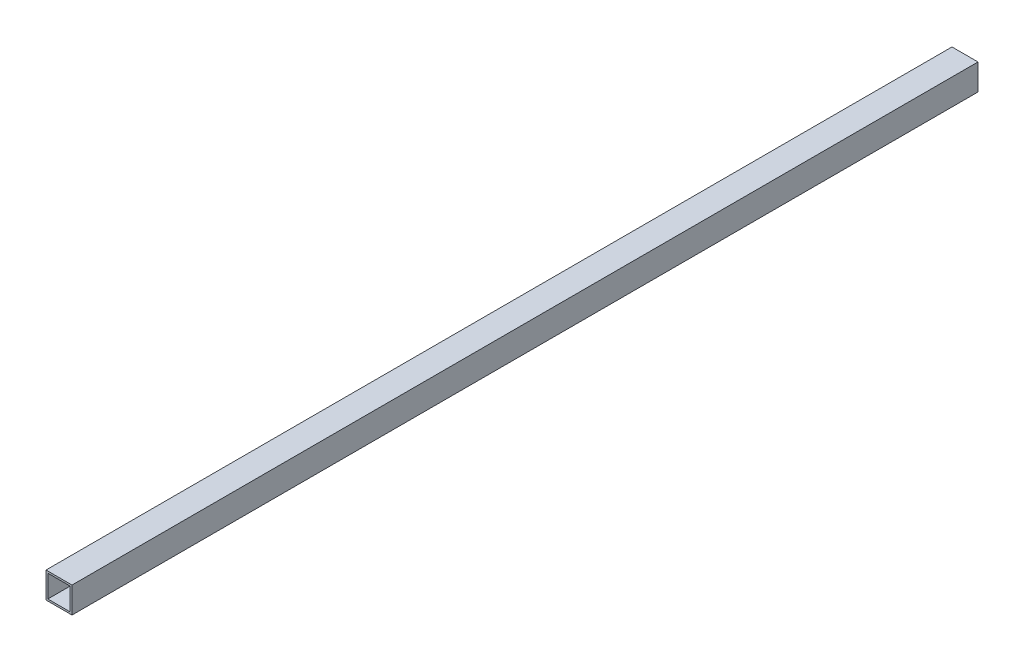
ISO-10303-21;
HEADER;
FILE_DESCRIPTION(('STEP AP214'),'2;1');
FILE_NAME('part.step','',(''),(''),'','','');
FILE_SCHEMA(('AUTOMOTIVE_DESIGN { 1 0 10303 214 1 1 1 1 }'));
ENDSEC;
DATA;
#1=APPLICATION_CONTEXT('core data for automotive mechanical design processes');
#2=APPLICATION_PROTOCOL_DEFINITION('international standard','automotive_design',2000,#1);
#3=PRODUCT_CONTEXT('',#1,'mechanical');
#4=PRODUCT('Part','Part','',(#3));
#5=PRODUCT_RELATED_PRODUCT_CATEGORY('part','',(#4));
#6=PRODUCT_DEFINITION_FORMATION('','',#4);
#7=PRODUCT_DEFINITION_CONTEXT('part definition',#1,'design');
#8=PRODUCT_DEFINITION('design','',#6,#7);
#9=PRODUCT_DEFINITION_SHAPE('','',#8);
#10=(LENGTH_UNIT() NAMED_UNIT(*) SI_UNIT(.MILLI.,.METRE.));
#11=(NAMED_UNIT(*) PLANE_ANGLE_UNIT() SI_UNIT($,.RADIAN.));
#12=(NAMED_UNIT(*) SI_UNIT($,.STERADIAN.) SOLID_ANGLE_UNIT());
#13=UNCERTAINTY_MEASURE_WITH_UNIT(LENGTH_MEASURE(1.E-05),#10,'distance_accuracy_value','');
#14=(GEOMETRIC_REPRESENTATION_CONTEXT(3) GLOBAL_UNCERTAINTY_ASSIGNED_CONTEXT((#13)) GLOBAL_UNIT_ASSIGNED_CONTEXT((#10,
#11,#12)) REPRESENTATION_CONTEXT('',''));
#15=CARTESIAN_POINT('',(0.,0.,0.));
#16=DIRECTION('',(0.,0.,1.));
#17=DIRECTION('',(1.,0.,0.));
#18=AXIS2_PLACEMENT_3D('',#15,#16,#17);
#19=CARTESIAN_POINT('',(0.,0.,592.));
#20=DIRECTION('',(0.,0.,-1.));
#21=DIRECTION('',(-1.,0.,0.));
#22=AXIS2_PLACEMENT_3D('',#19,#20,#21);
#23=PLANE('',#22);
#24=DIRECTION('',(0.,1.,0.));
#25=VECTOR('',#24,1.);
#26=CARTESIAN_POINT('',(8.5,-8.5,592.));
#27=LINE('',#26,#25);
#28=CARTESIAN_POINT('',(8.5,-8.5,592.));
#29=VERTEX_POINT('',#28);
#30=CARTESIAN_POINT('',(8.5,8.5,592.));
#31=VERTEX_POINT('',#30);
#32=EDGE_CURVE('E153',#29,#31,#27,.T.);
#33=ORIENTED_EDGE('',*,*,#32,.T.);
#34=DIRECTION('',(-1.,0.,0.));
#35=VECTOR('',#34,1.);
#36=CARTESIAN_POINT('',(-8.5,8.5,592.));
#37=LINE('',#36,#35);
#38=CARTESIAN_POINT('',(-8.5,8.5,592.));
#39=VERTEX_POINT('',#38);
#40=EDGE_CURVE('E157',#31,#39,#37,.T.);
#41=ORIENTED_EDGE('',*,*,#40,.T.);
#42=DIRECTION('',(0.,-1.,0.));
#43=VECTOR('',#42,1.);
#44=CARTESIAN_POINT('',(-8.5,-8.5,592.));
#45=LINE('',#44,#43);
#46=CARTESIAN_POINT('',(-8.5,-8.5,592.));
#47=VERTEX_POINT('',#46);
#48=EDGE_CURVE('E161',#39,#47,#45,.T.);
#49=ORIENTED_EDGE('',*,*,#48,.T.);
#50=DIRECTION('',(1.,0.,0.));
#51=VECTOR('',#50,1.);
#52=CARTESIAN_POINT('',(-8.5,-8.5,592.));
#53=LINE('',#52,#51);
#54=EDGE_CURVE('E164',#47,#29,#53,.T.);
#55=ORIENTED_EDGE('',*,*,#54,.T.);
#56=EDGE_LOOP('',(#33,#41,#49,#55));
#57=FACE_BOUND('',#56,.T.);
#58=DIRECTION('',(0.,-1.,0.));
#59=VECTOR('',#58,1.);
#60=CARTESIAN_POINT('',(-7.3,-7.3,592.));
#61=LINE('',#60,#59);
#62=CARTESIAN_POINT('',(-7.3,7.3,592.));
#63=VERTEX_POINT('',#62);
#64=CARTESIAN_POINT('',(-7.3,-7.3,592.));
#65=VERTEX_POINT('',#64);
#66=EDGE_CURVE('E105',#63,#65,#61,.T.);
#67=ORIENTED_EDGE('',*,*,#66,.F.);
#68=DIRECTION('',(-1.,0.,0.));
#69=VECTOR('',#68,1.);
#70=CARTESIAN_POINT('',(-7.3,7.3,592.));
#71=LINE('',#70,#69);
#72=CARTESIAN_POINT('',(7.3,7.3,592.));
#73=VERTEX_POINT('',#72);
#74=EDGE_CURVE('E131',#73,#63,#71,.T.);
#75=ORIENTED_EDGE('',*,*,#74,.F.);
#76=DIRECTION('',(0.,1.,0.));
#77=VECTOR('',#76,1.);
#78=CARTESIAN_POINT('',(7.3,-7.3,592.));
#79=LINE('',#78,#77);
#80=CARTESIAN_POINT('',(7.3,-7.3,592.));
#81=VERTEX_POINT('',#80);
#82=EDGE_CURVE('E127',#81,#73,#79,.T.);
#83=ORIENTED_EDGE('',*,*,#82,.F.);
#84=DIRECTION('',(1.,0.,0.));
#85=VECTOR('',#84,1.);
#86=CARTESIAN_POINT('',(-7.3,-7.3,592.));
#87=LINE('',#86,#85);
#88=EDGE_CURVE('E114',#65,#81,#87,.T.);
#89=ORIENTED_EDGE('',*,*,#88,.F.);
#90=EDGE_LOOP('',(#67,#75,#83,#89));
#91=FACE_BOUND('',#90,.T.);
#92=ADVANCED_FACE('F39',(#57,#91),#23,.F.);
#93=CARTESIAN_POINT('',(0.,0.,0.));
#94=DIRECTION('',(0.,0.,-1.));
#95=DIRECTION('',(-1.,0.,0.));
#96=AXIS2_PLACEMENT_3D('',#93,#94,#95);
#97=PLANE('',#96);
#98=DIRECTION('',(0.,1.,0.));
#99=VECTOR('',#98,1.);
#100=CARTESIAN_POINT('',(8.5,-8.5,0.));
#101=LINE('',#100,#99);
#102=CARTESIAN_POINT('',(8.5,-8.5,0.));
#103=VERTEX_POINT('',#102);
#104=CARTESIAN_POINT('',(8.5,8.5,0.));
#105=VERTEX_POINT('',#104);
#106=EDGE_CURVE('E123',#103,#105,#101,.T.);
#107=ORIENTED_EDGE('',*,*,#106,.F.);
#108=DIRECTION('',(1.,0.,0.));
#109=VECTOR('',#108,1.);
#110=CARTESIAN_POINT('',(-8.5,-8.5,0.));
#111=LINE('',#110,#109);
#112=CARTESIAN_POINT('',(-8.5,-8.5,0.));
#113=VERTEX_POINT('',#112);
#114=EDGE_CURVE('E158',#113,#103,#111,.T.);
#115=ORIENTED_EDGE('',*,*,#114,.F.);
#116=DIRECTION('',(0.,-1.,0.));
#117=VECTOR('',#116,1.);
#118=CARTESIAN_POINT('',(-8.5,-8.5,0.));
#119=LINE('',#118,#117);
#120=CARTESIAN_POINT('',(-8.5,8.5,0.));
#121=VERTEX_POINT('',#120);
#122=EDGE_CURVE('E174',#121,#113,#119,.T.);
#123=ORIENTED_EDGE('',*,*,#122,.F.);
#124=DIRECTION('',(-1.,0.,0.));
#125=VECTOR('',#124,1.);
#126=CARTESIAN_POINT('',(-8.5,8.5,0.));
#127=LINE('',#126,#125);
#128=EDGE_CURVE('E171',#105,#121,#127,.T.);
#129=ORIENTED_EDGE('',*,*,#128,.F.);
#130=EDGE_LOOP('',(#107,#115,#123,#129));
#131=FACE_BOUND('',#130,.T.);
#132=DIRECTION('',(-1.,0.,0.));
#133=VECTOR('',#132,1.);
#134=CARTESIAN_POINT('',(-7.3,7.3,0.));
#135=LINE('',#134,#133);
#136=CARTESIAN_POINT('',(7.3,7.3,0.));
#137=VERTEX_POINT('',#136);
#138=CARTESIAN_POINT('',(-7.3,7.3,0.));
#139=VERTEX_POINT('',#138);
#140=EDGE_CURVE('E115',#137,#139,#135,.T.);
#141=ORIENTED_EDGE('',*,*,#140,.T.);
#142=DIRECTION('',(0.,-1.,0.));
#143=VECTOR('',#142,1.);
#144=CARTESIAN_POINT('',(-7.3,-7.3,0.));
#145=LINE('',#144,#143);
#146=CARTESIAN_POINT('',(-7.3,-7.3,0.));
#147=VERTEX_POINT('',#146);
#148=EDGE_CURVE('E63',#139,#147,#145,.T.);
#149=ORIENTED_EDGE('',*,*,#148,.T.);
#150=DIRECTION('',(1.,0.,0.));
#151=VECTOR('',#150,1.);
#152=CARTESIAN_POINT('',(-7.3,-7.3,0.));
#153=LINE('',#152,#151);
#154=CARTESIAN_POINT('',(7.3,-7.3,0.));
#155=VERTEX_POINT('',#154);
#156=EDGE_CURVE('E121',#147,#155,#153,.T.);
#157=ORIENTED_EDGE('',*,*,#156,.T.);
#158=DIRECTION('',(0.,1.,0.));
#159=VECTOR('',#158,1.);
#160=CARTESIAN_POINT('',(7.3,-7.3,0.));
#161=LINE('',#160,#159);
#162=EDGE_CURVE('E140',#155,#137,#161,.T.);
#163=ORIENTED_EDGE('',*,*,#162,.T.);
#164=EDGE_LOOP('',(#141,#149,#157,#163));
#165=FACE_BOUND('',#164,.T.);
#166=ADVANCED_FACE('F197',(#131,#165),#97,.T.);
#167=CARTESIAN_POINT('',(8.5,-8.5,592.));
#168=DIRECTION('',(-1.,0.,0.));
#169=DIRECTION('',(0.,0.,1.));
#170=AXIS2_PLACEMENT_3D('',#167,#168,#169);
#171=PLANE('',#170);
#172=ORIENTED_EDGE('',*,*,#106,.T.);
#173=DIRECTION('',(0.,0.,-1.));
#174=VECTOR('',#173,1.);
#175=CARTESIAN_POINT('',(8.5,8.5,592.));
#176=LINE('',#175,#174);
#177=EDGE_CURVE('E11',#31,#105,#176,.T.);
#178=ORIENTED_EDGE('',*,*,#177,.F.);
#179=ORIENTED_EDGE('',*,*,#32,.F.);
#180=DIRECTION('',(0.,0.,-1.));
#181=VECTOR('',#180,1.);
#182=CARTESIAN_POINT('',(8.5,-8.5,592.));
#183=LINE('',#182,#181);
#184=EDGE_CURVE('E167',#29,#103,#183,.T.);
#185=ORIENTED_EDGE('',*,*,#184,.T.);
#186=EDGE_LOOP('',(#172,#178,#179,#185));
#187=FACE_BOUND('',#186,.T.);
#188=ADVANCED_FACE('F41',(#187),#171,.F.);
#189=CARTESIAN_POINT('',(-8.5,8.5,592.));
#190=DIRECTION('',(0.,-1.,0.));
#191=DIRECTION('',(0.,0.,-1.));
#192=AXIS2_PLACEMENT_3D('',#189,#190,#191);
#193=PLANE('',#192);
#194=ORIENTED_EDGE('',*,*,#128,.T.);
#195=DIRECTION('',(0.,0.,-1.));
#196=VECTOR('',#195,1.);
#197=CARTESIAN_POINT('',(-8.5,8.5,592.));
#198=LINE('',#197,#196);
#199=EDGE_CURVE('E48',#39,#121,#198,.T.);
#200=ORIENTED_EDGE('',*,*,#199,.F.);
#201=ORIENTED_EDGE('',*,*,#40,.F.);
#202=ORIENTED_EDGE('',*,*,#177,.T.);
#203=EDGE_LOOP('',(#194,#200,#201,#202));
#204=FACE_BOUND('',#203,.T.);
#205=ADVANCED_FACE('F207',(#204),#193,.F.);
#206=CARTESIAN_POINT('',(-8.5,-8.5,592.));
#207=DIRECTION('',(1.,0.,0.));
#208=DIRECTION('',(0.,0.,-1.));
#209=AXIS2_PLACEMENT_3D('',#206,#207,#208);
#210=PLANE('',#209);
#211=ORIENTED_EDGE('',*,*,#122,.T.);
#212=DIRECTION('',(0.,0.,-1.));
#213=VECTOR('',#212,1.);
#214=CARTESIAN_POINT('',(-8.5,-8.5,592.));
#215=LINE('',#214,#213);
#216=EDGE_CURVE('E182',#47,#113,#215,.T.);
#217=ORIENTED_EDGE('',*,*,#216,.F.);
#218=ORIENTED_EDGE('',*,*,#48,.F.);
#219=ORIENTED_EDGE('',*,*,#199,.T.);
#220=EDGE_LOOP('',(#211,#217,#218,#219));
#221=FACE_BOUND('',#220,.T.);
#222=ADVANCED_FACE('F191',(#221),#210,.F.);
#223=CARTESIAN_POINT('',(-8.5,-8.5,592.));
#224=DIRECTION('',(0.,1.,0.));
#225=DIRECTION('',(0.,0.,1.));
#226=AXIS2_PLACEMENT_3D('',#223,#224,#225);
#227=PLANE('',#226);
#228=ORIENTED_EDGE('',*,*,#114,.T.);
#229=ORIENTED_EDGE('',*,*,#184,.F.);
#230=ORIENTED_EDGE('',*,*,#54,.F.);
#231=ORIENTED_EDGE('',*,*,#216,.T.);
#232=EDGE_LOOP('',(#228,#229,#230,#231));
#233=FACE_BOUND('',#232,.T.);
#234=ADVANCED_FACE('F201',(#233),#227,.F.);
#235=CARTESIAN_POINT('',(-7.3,-7.3,592.));
#236=DIRECTION('',(1.,0.,0.));
#237=DIRECTION('',(0.,0.,-1.));
#238=AXIS2_PLACEMENT_3D('',#235,#236,#237);
#239=PLANE('',#238);
#240=ORIENTED_EDGE('',*,*,#148,.F.);
#241=DIRECTION('',(0.,0.,-1.));
#242=VECTOR('',#241,1.);
#243=CARTESIAN_POINT('',(-7.3,7.3,592.));
#244=LINE('',#243,#242);
#245=EDGE_CURVE('E109',#63,#139,#244,.T.);
#246=ORIENTED_EDGE('',*,*,#245,.F.);
#247=ORIENTED_EDGE('',*,*,#66,.T.);
#248=DIRECTION('',(0.,0.,-1.));
#249=VECTOR('',#248,1.);
#250=CARTESIAN_POINT('',(-7.3,-7.3,592.));
#251=LINE('',#250,#249);
#252=EDGE_CURVE('E108',#65,#147,#251,.T.);
#253=ORIENTED_EDGE('',*,*,#252,.T.);
#254=EDGE_LOOP('',(#240,#246,#247,#253));
#255=FACE_BOUND('',#254,.T.);
#256=ADVANCED_FACE('F107',(#255),#239,.T.);
#257=CARTESIAN_POINT('',(-7.3,-7.3,592.));
#258=DIRECTION('',(0.,1.,0.));
#259=DIRECTION('',(0.,0.,1.));
#260=AXIS2_PLACEMENT_3D('',#257,#258,#259);
#261=PLANE('',#260);
#262=ORIENTED_EDGE('',*,*,#156,.F.);
#263=ORIENTED_EDGE('',*,*,#252,.F.);
#264=ORIENTED_EDGE('',*,*,#88,.T.);
#265=DIRECTION('',(0.,0.,-1.));
#266=VECTOR('',#265,1.);
#267=CARTESIAN_POINT('',(7.3,-7.3,592.));
#268=LINE('',#267,#266);
#269=EDGE_CURVE('E124',#81,#155,#268,.T.);
#270=ORIENTED_EDGE('',*,*,#269,.T.);
#271=EDGE_LOOP('',(#262,#263,#264,#270));
#272=FACE_BOUND('',#271,.T.);
#273=ADVANCED_FACE('F118',(#272),#261,.T.);
#274=CARTESIAN_POINT('',(7.3,-7.3,592.));
#275=DIRECTION('',(-1.,0.,0.));
#276=DIRECTION('',(0.,0.,1.));
#277=AXIS2_PLACEMENT_3D('',#274,#275,#276);
#278=PLANE('',#277);
#279=ORIENTED_EDGE('',*,*,#162,.F.);
#280=ORIENTED_EDGE('',*,*,#269,.F.);
#281=ORIENTED_EDGE('',*,*,#82,.T.);
#282=DIRECTION('',(0.,0.,-1.));
#283=VECTOR('',#282,1.);
#284=CARTESIAN_POINT('',(7.3,7.3,592.));
#285=LINE('',#284,#283);
#286=EDGE_CURVE('E55',#73,#137,#285,.T.);
#287=ORIENTED_EDGE('',*,*,#286,.T.);
#288=EDGE_LOOP('',(#279,#280,#281,#287));
#289=FACE_BOUND('',#288,.T.);
#290=ADVANCED_FACE('F230',(#289),#278,.T.);
#291=CARTESIAN_POINT('',(-7.3,7.3,592.));
#292=DIRECTION('',(0.,-1.,0.));
#293=DIRECTION('',(0.,0.,-1.));
#294=AXIS2_PLACEMENT_3D('',#291,#292,#293);
#295=PLANE('',#294);
#296=ORIENTED_EDGE('',*,*,#140,.F.);
#297=ORIENTED_EDGE('',*,*,#286,.F.);
#298=ORIENTED_EDGE('',*,*,#74,.T.);
#299=ORIENTED_EDGE('',*,*,#245,.T.);
#300=EDGE_LOOP('',(#296,#297,#298,#299));
#301=FACE_BOUND('',#300,.T.);
#302=ADVANCED_FACE('F234',(#301),#295,.T.);
#303=CLOSED_SHELL('',(#92,#166,#188,#205,#222,#234,#256,#273,#290,#302));
#304=MANIFOLD_SOLID_BREP('B2',#303);
#305=ADVANCED_BREP_SHAPE_REPRESENTATION('',(#18,#304),#14);
#306=SHAPE_DEFINITION_REPRESENTATION(#9,#305);
ENDSEC;
END-ISO-10303-21;
